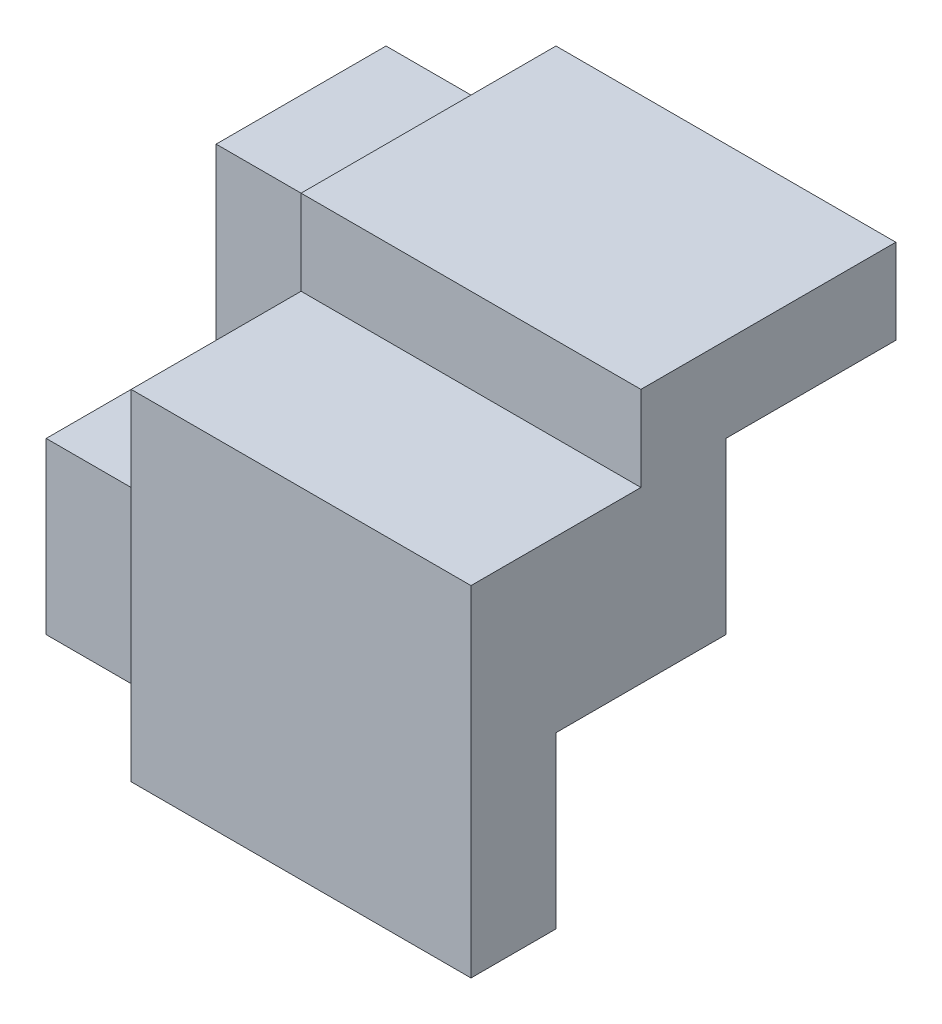
ISO-10303-21;
HEADER;
FILE_DESCRIPTION(('STEP AP214'),'2;1');
FILE_NAME('part.step','',(''),(''),'','','');
FILE_SCHEMA(('AUTOMOTIVE_DESIGN { 1 0 10303 214 1 1 1 1 }'));
ENDSEC;
DATA;
#1=APPLICATION_CONTEXT('core data for automotive mechanical design processes');
#2=APPLICATION_PROTOCOL_DEFINITION('international standard','automotive_design',2000,#1);
#3=PRODUCT_CONTEXT('',#1,'mechanical');
#4=PRODUCT('Part','Part','',(#3));
#5=PRODUCT_RELATED_PRODUCT_CATEGORY('part','',(#4));
#6=PRODUCT_DEFINITION_FORMATION('','',#4);
#7=PRODUCT_DEFINITION_CONTEXT('part definition',#1,'design');
#8=PRODUCT_DEFINITION('design','',#6,#7);
#9=PRODUCT_DEFINITION_SHAPE('','',#8);
#10=(LENGTH_UNIT() NAMED_UNIT(*) SI_UNIT(.MILLI.,.METRE.));
#11=(NAMED_UNIT(*) PLANE_ANGLE_UNIT() SI_UNIT($,.RADIAN.));
#12=(NAMED_UNIT(*) SI_UNIT($,.STERADIAN.) SOLID_ANGLE_UNIT());
#13=UNCERTAINTY_MEASURE_WITH_UNIT(LENGTH_MEASURE(1.E-05),#10,'distance_accuracy_value','');
#14=(GEOMETRIC_REPRESENTATION_CONTEXT(3) GLOBAL_UNCERTAINTY_ASSIGNED_CONTEXT((#13)) GLOBAL_UNIT_ASSIGNED_CONTEXT((#10,
#11,#12)) REPRESENTATION_CONTEXT('',''));
#15=CARTESIAN_POINT('',(0.,0.,0.));
#16=DIRECTION('',(0.,0.,1.));
#17=DIRECTION('',(1.,0.,0.));
#18=AXIS2_PLACEMENT_3D('',#15,#16,#17);
#19=CARTESIAN_POINT('',(0.,20.,0.));
#20=DIRECTION('',(0.,-1.,0.));
#21=DIRECTION('',(0.,0.,-1.));
#22=AXIS2_PLACEMENT_3D('',#19,#20,#21);
#23=PLANE('',#22);
#24=DIRECTION('',(0.,0.,-1.));
#25=VECTOR('',#24,1.);
#26=CARTESIAN_POINT('',(40.,20.,0.));
#27=LINE('',#26,#25);
#28=CARTESIAN_POINT('',(40.,20.,40.));
#29=VERTEX_POINT('',#28);
#30=CARTESIAN_POINT('',(40.,20.,20.));
#31=VERTEX_POINT('',#30);
#32=EDGE_CURVE('E181',#29,#31,#27,.T.);
#33=ORIENTED_EDGE('',*,*,#32,.T.);
#34=DIRECTION('',(-1.,0.,0.));
#35=VECTOR('',#34,1.);
#36=CARTESIAN_POINT('',(40.,20.,20.));
#37=LINE('',#36,#35);
#38=CARTESIAN_POINT('',(60.,20.,20.));
#39=VERTEX_POINT('',#38);
#40=EDGE_CURVE('E159',#39,#31,#37,.T.);
#41=ORIENTED_EDGE('',*,*,#40,.F.);
#42=DIRECTION('',(0.,0.,1.));
#43=VECTOR('',#42,1.);
#44=CARTESIAN_POINT('',(60.,20.,0.));
#45=LINE('',#44,#43);
#46=CARTESIAN_POINT('',(60.,20.,40.));
#47=VERTEX_POINT('',#46);
#48=EDGE_CURVE('E175',#39,#47,#45,.T.);
#49=ORIENTED_EDGE('',*,*,#48,.T.);
#50=DIRECTION('',(-1.,0.,0.));
#51=VECTOR('',#50,1.);
#52=CARTESIAN_POINT('',(60.,20.,40.));
#53=LINE('',#52,#51);
#54=EDGE_CURVE('E177',#47,#29,#53,.T.);
#55=ORIENTED_EDGE('',*,*,#54,.T.);
#56=EDGE_LOOP('',(#33,#41,#49,#55));
#57=FACE_BOUND('',#56,.T.);
#58=ADVANCED_FACE('F35',(#57),#23,.T.);
#59=CARTESIAN_POINT('',(0.,40.,0.));
#60=DIRECTION('',(0.,-1.,0.));
#61=DIRECTION('',(0.,0.,-1.));
#62=AXIS2_PLACEMENT_3D('',#59,#60,#61);
#63=PLANE('',#62);
#64=DIRECTION('',(1.,0.,0.));
#65=VECTOR('',#64,1.);
#66=CARTESIAN_POINT('',(60.,40.,30.));
#67=LINE('',#66,#65);
#68=CARTESIAN_POINT('',(20.,40.,30.));
#69=VERTEX_POINT('',#68);
#70=CARTESIAN_POINT('',(60.,40.,30.));
#71=VERTEX_POINT('',#70);
#72=EDGE_CURVE('E58',#69,#71,#67,.T.);
#73=ORIENTED_EDGE('',*,*,#72,.F.);
#74=DIRECTION('',(0.,0.,-1.));
#75=VECTOR('',#74,1.);
#76=CARTESIAN_POINT('',(20.,40.,0.));
#77=LINE('',#76,#75);
#78=CARTESIAN_POINT('',(20.,40.,50.));
#79=VERTEX_POINT('',#78);
#80=EDGE_CURVE('E11',#79,#69,#77,.T.);
#81=ORIENTED_EDGE('',*,*,#80,.F.);
#82=DIRECTION('',(1.,0.,0.));
#83=VECTOR('',#82,1.);
#84=CARTESIAN_POINT('',(60.,40.,50.));
#85=LINE('',#84,#83);
#86=CARTESIAN_POINT('',(60.,40.,50.));
#87=VERTEX_POINT('',#86);
#88=EDGE_CURVE('E224',#79,#87,#85,.T.);
#89=ORIENTED_EDGE('',*,*,#88,.T.);
#90=DIRECTION('',(0.,0.,1.));
#91=VECTOR('',#90,1.);
#92=CARTESIAN_POINT('',(60.,40.,20.));
#93=LINE('',#92,#91);
#94=EDGE_CURVE('E227',#71,#87,#93,.T.);
#95=ORIENTED_EDGE('',*,*,#94,.F.);
#96=EDGE_LOOP('',(#73,#81,#89,#95));
#97=FACE_BOUND('',#96,.T.);
#98=ADVANCED_FACE('F325',(#97),#63,.F.);
#99=CARTESIAN_POINT('',(0.,0.,50.));
#100=DIRECTION('',(1.,0.,0.));
#101=DIRECTION('',(0.,0.,-1.));
#102=AXIS2_PLACEMENT_3D('',#99,#100,#101);
#103=PLANE('',#102);
#104=DIRECTION('',(0.,-1.,0.));
#105=VECTOR('',#104,1.);
#106=CARTESIAN_POINT('',(0.,20.,40.));
#107=LINE('',#106,#105);
#108=CARTESIAN_POINT('',(0.,20.,40.));
#109=VERTEX_POINT('',#108);
#110=CARTESIAN_POINT('',(0.,0.,40.));
#111=VERTEX_POINT('',#110);
#112=EDGE_CURVE('E201',#109,#111,#107,.T.);
#113=ORIENTED_EDGE('',*,*,#112,.F.);
#114=DIRECTION('',(0.,0.,1.));
#115=VECTOR('',#114,1.);
#116=CARTESIAN_POINT('',(0.,20.,30.));
#117=LINE('',#116,#115);
#118=CARTESIAN_POINT('',(0.,20.,20.));
#119=VERTEX_POINT('',#118);
#120=EDGE_CURVE('E229',#119,#109,#117,.T.);
#121=ORIENTED_EDGE('',*,*,#120,.F.);
#122=DIRECTION('',(0.,-1.,0.));
#123=VECTOR('',#122,1.);
#124=CARTESIAN_POINT('',(0.,20.,20.));
#125=LINE('',#124,#123);
#126=CARTESIAN_POINT('',(0.,40.,20.));
#127=VERTEX_POINT('',#126);
#128=EDGE_CURVE('E218',#127,#119,#125,.T.);
#129=ORIENTED_EDGE('',*,*,#128,.F.);
#130=DIRECTION('',(0.,0.,1.));
#131=VECTOR('',#130,1.);
#132=CARTESIAN_POINT('',(0.,40.,0.));
#133=LINE('',#132,#131);
#134=CARTESIAN_POINT('',(0.,40.,0.));
#135=VERTEX_POINT('',#134);
#136=EDGE_CURVE('E242',#135,#127,#133,.T.);
#137=ORIENTED_EDGE('',*,*,#136,.F.);
#138=DIRECTION('',(0.,-1.,0.));
#139=VECTOR('',#138,1.);
#140=CARTESIAN_POINT('',(0.,0.,0.));
#141=LINE('',#140,#139);
#142=CARTESIAN_POINT('',(0.,0.,0.));
#143=VERTEX_POINT('',#142);
#144=EDGE_CURVE('E247',#135,#143,#141,.T.);
#145=ORIENTED_EDGE('',*,*,#144,.T.);
#146=DIRECTION('',(0.,0.,-1.));
#147=VECTOR('',#146,1.);
#148=CARTESIAN_POINT('',(0.,0.,50.));
#149=LINE('',#148,#147);
#150=EDGE_CURVE('E43',#111,#143,#149,.T.);
#151=ORIENTED_EDGE('',*,*,#150,.F.);
#152=EDGE_LOOP('',(#113,#121,#129,#137,#145,#151));
#153=FACE_BOUND('',#152,.T.);
#154=ADVANCED_FACE('F37',(#153),#103,.F.);
#155=CARTESIAN_POINT('',(0.,20.,30.));
#156=DIRECTION('',(0.,-1.,0.));
#157=DIRECTION('',(0.,0.,-1.));
#158=AXIS2_PLACEMENT_3D('',#155,#156,#157);
#159=PLANE('',#158);
#160=DIRECTION('',(-1.,0.,0.));
#161=VECTOR('',#160,1.);
#162=CARTESIAN_POINT('',(0.,20.,40.));
#163=LINE('',#162,#161);
#164=CARTESIAN_POINT('',(20.,20.,40.));
#165=VERTEX_POINT('',#164);
#166=EDGE_CURVE('E208',#165,#109,#163,.T.);
#167=ORIENTED_EDGE('',*,*,#166,.F.);
#168=DIRECTION('',(0.,0.,1.));
#169=VECTOR('',#168,1.);
#170=CARTESIAN_POINT('',(20.,20.,30.));
#171=LINE('',#170,#169);
#172=CARTESIAN_POINT('',(20.,20.,20.));
#173=VERTEX_POINT('',#172);
#174=EDGE_CURVE('E230',#173,#165,#171,.T.);
#175=ORIENTED_EDGE('',*,*,#174,.F.);
#176=DIRECTION('',(1.,0.,0.));
#177=VECTOR('',#176,1.);
#178=CARTESIAN_POINT('',(20.,20.,20.));
#179=LINE('',#178,#177);
#180=EDGE_CURVE('E221',#119,#173,#179,.T.);
#181=ORIENTED_EDGE('',*,*,#180,.F.);
#182=ORIENTED_EDGE('',*,*,#120,.T.);
#183=EDGE_LOOP('',(#167,#175,#181,#182));
#184=FACE_BOUND('',#183,.T.);
#185=ADVANCED_FACE('F312',(#184),#159,.F.);
#186=DIRECTION('',(-1.,0.,0.));
#187=VECTOR('',#186,1.);
#188=CARTESIAN_POINT('',(20.,40.,20.));
#189=LINE('',#188,#187);
#190=CARTESIAN_POINT('',(20.,40.,20.));
#191=VERTEX_POINT('',#190);
#192=EDGE_CURVE('E216',#191,#127,#189,.T.);
#193=ORIENTED_EDGE('',*,*,#192,.F.);
#194=DIRECTION('',(0.,0.,1.));
#195=VECTOR('',#194,1.);
#196=CARTESIAN_POINT('',(20.,40.,0.));
#197=LINE('',#196,#195);
#198=CARTESIAN_POINT('',(20.,40.,0.));
#199=VERTEX_POINT('',#198);
#200=EDGE_CURVE('E248',#199,#191,#197,.T.);
#201=ORIENTED_EDGE('',*,*,#200,.F.);
#202=DIRECTION('',(1.,0.,0.));
#203=VECTOR('',#202,1.);
#204=CARTESIAN_POINT('',(0.,40.,0.));
#205=LINE('',#204,#203);
#206=EDGE_CURVE('E236',#135,#199,#205,.T.);
#207=ORIENTED_EDGE('',*,*,#206,.F.);
#208=ORIENTED_EDGE('',*,*,#136,.T.);
#209=EDGE_LOOP('',(#193,#201,#207,#208));
#210=FACE_BOUND('',#209,.T.);
#211=ADVANCED_FACE('F317',(#210),#63,.F.);
#212=CARTESIAN_POINT('',(0.,0.,50.));
#213=DIRECTION('',(0.,1.,0.));
#214=DIRECTION('',(0.,0.,1.));
#215=AXIS2_PLACEMENT_3D('',#212,#213,#214);
#216=PLANE('',#215);
#217=DIRECTION('',(1.,0.,0.));
#218=VECTOR('',#217,1.);
#219=CARTESIAN_POINT('',(0.,0.,0.));
#220=LINE('',#219,#218);
#221=CARTESIAN_POINT('',(40.,0.,0.));
#222=VERTEX_POINT('',#221);
#223=EDGE_CURVE('E261',#143,#222,#220,.T.);
#224=ORIENTED_EDGE('',*,*,#223,.T.);
#225=DIRECTION('',(0.,0.,-1.));
#226=VECTOR('',#225,1.);
#227=CARTESIAN_POINT('',(40.,0.,0.));
#228=LINE('',#227,#226);
#229=CARTESIAN_POINT('',(40.,0.,40.));
#230=VERTEX_POINT('',#229);
#231=EDGE_CURVE('E178',#230,#222,#228,.T.);
#232=ORIENTED_EDGE('',*,*,#231,.F.);
#233=DIRECTION('',(-1.,0.,0.));
#234=VECTOR('',#233,1.);
#235=CARTESIAN_POINT('',(60.,0.,40.));
#236=LINE('',#235,#234);
#237=CARTESIAN_POINT('',(60.,0.,40.));
#238=VERTEX_POINT('',#237);
#239=EDGE_CURVE('E173',#238,#230,#236,.T.);
#240=ORIENTED_EDGE('',*,*,#239,.F.);
#241=DIRECTION('',(0.,0.,-1.));
#242=VECTOR('',#241,1.);
#243=CARTESIAN_POINT('',(60.,0.,50.));
#244=LINE('',#243,#242);
#245=CARTESIAN_POINT('',(60.,0.,50.));
#246=VERTEX_POINT('',#245);
#247=EDGE_CURVE('E270',#246,#238,#244,.T.);
#248=ORIENTED_EDGE('',*,*,#247,.F.);
#249=DIRECTION('',(1.,0.,0.));
#250=VECTOR('',#249,1.);
#251=CARTESIAN_POINT('',(0.,0.,50.));
#252=LINE('',#251,#250);
#253=CARTESIAN_POINT('',(20.,0.,50.));
#254=VERTEX_POINT('',#253);
#255=EDGE_CURVE('E252',#254,#246,#252,.T.);
#256=ORIENTED_EDGE('',*,*,#255,.F.);
#257=DIRECTION('',(0.,0.,1.));
#258=VECTOR('',#257,1.);
#259=CARTESIAN_POINT('',(20.,0.,40.));
#260=LINE('',#259,#258);
#261=CARTESIAN_POINT('',(20.,0.,40.));
#262=VERTEX_POINT('',#261);
#263=EDGE_CURVE('E210',#262,#254,#260,.T.);
#264=ORIENTED_EDGE('',*,*,#263,.F.);
#265=DIRECTION('',(1.,0.,0.));
#266=VECTOR('',#265,1.);
#267=CARTESIAN_POINT('',(0.,0.,40.));
#268=LINE('',#267,#266);
#269=EDGE_CURVE('E203',#111,#262,#268,.T.);
#270=ORIENTED_EDGE('',*,*,#269,.F.);
#271=ORIENTED_EDGE('',*,*,#150,.T.);
#272=EDGE_LOOP('',(#224,#232,#240,#248,#256,#264,#270,#271));
#273=FACE_BOUND('',#272,.T.);
#274=ADVANCED_FACE('F275',(#273),#216,.F.);
#275=CARTESIAN_POINT('',(60.,0.,50.));
#276=DIRECTION('',(-1.,0.,0.));
#277=DIRECTION('',(0.,0.,1.));
#278=AXIS2_PLACEMENT_3D('',#275,#276,#277);
#279=PLANE('',#278);
#280=DIRECTION('',(0.,-1.,0.));
#281=VECTOR('',#280,1.);
#282=CARTESIAN_POINT('',(60.,20.,20.));
#283=LINE('',#282,#281);
#284=CARTESIAN_POINT('',(60.,40.,20.));
#285=VERTEX_POINT('',#284);
#286=EDGE_CURVE('E50',#285,#39,#283,.T.);
#287=ORIENTED_EDGE('',*,*,#286,.F.);
#288=DIRECTION('',(0.,0.,-1.));
#289=VECTOR('',#288,1.);
#290=CARTESIAN_POINT('',(60.,40.,20.));
#291=LINE('',#290,#289);
#292=CARTESIAN_POINT('',(60.,40.,0.));
#293=VERTEX_POINT('',#292);
#294=EDGE_CURVE('E158',#285,#293,#291,.T.);
#295=ORIENTED_EDGE('',*,*,#294,.T.);
#296=DIRECTION('',(0.,1.,0.));
#297=VECTOR('',#296,1.);
#298=CARTESIAN_POINT('',(60.,0.,0.));
#299=LINE('',#298,#297);
#300=CARTESIAN_POINT('',(60.,50.,0.));
#301=VERTEX_POINT('',#300);
#302=EDGE_CURVE('E264',#293,#301,#299,.T.);
#303=ORIENTED_EDGE('',*,*,#302,.T.);
#304=DIRECTION('',(0.,0.,-1.));
#305=VECTOR('',#304,1.);
#306=CARTESIAN_POINT('',(60.,50.,50.));
#307=LINE('',#306,#305);
#308=CARTESIAN_POINT('',(60.,50.,30.));
#309=VERTEX_POINT('',#308);
#310=EDGE_CURVE('E258',#309,#301,#307,.T.);
#311=ORIENTED_EDGE('',*,*,#310,.F.);
#312=DIRECTION('',(0.,1.,0.));
#313=VECTOR('',#312,1.);
#314=CARTESIAN_POINT('',(60.,50.,30.));
#315=LINE('',#314,#313);
#316=EDGE_CURVE('E188',#71,#309,#315,.T.);
#317=ORIENTED_EDGE('',*,*,#316,.F.);
#318=ORIENTED_EDGE('',*,*,#94,.T.);
#319=DIRECTION('',(0.,1.,0.));
#320=VECTOR('',#319,1.);
#321=CARTESIAN_POINT('',(60.,0.,50.));
#322=LINE('',#321,#320);
#323=EDGE_CURVE('E254',#246,#87,#322,.T.);
#324=ORIENTED_EDGE('',*,*,#323,.F.);
#325=ORIENTED_EDGE('',*,*,#247,.T.);
#326=DIRECTION('',(0.,-1.,0.));
#327=VECTOR('',#326,1.);
#328=CARTESIAN_POINT('',(60.,20.,40.));
#329=LINE('',#328,#327);
#330=EDGE_CURVE('E183',#47,#238,#329,.T.);
#331=ORIENTED_EDGE('',*,*,#330,.F.);
#332=ORIENTED_EDGE('',*,*,#48,.F.);
#333=EDGE_LOOP('',(#287,#295,#303,#311,#317,#318,#324,#325,#331,#332));
#334=FACE_BOUND('',#333,.T.);
#335=ADVANCED_FACE('F289',(#334),#279,.F.);
#336=CARTESIAN_POINT('',(0.,50.,50.));
#337=DIRECTION('',(0.,-1.,0.));
#338=DIRECTION('',(0.,0.,-1.));
#339=AXIS2_PLACEMENT_3D('',#336,#337,#338);
#340=PLANE('',#339);
#341=DIRECTION('',(0.,0.,1.));
#342=VECTOR('',#341,1.);
#343=CARTESIAN_POINT('',(20.,50.,0.));
#344=LINE('',#343,#342);
#345=CARTESIAN_POINT('',(20.,50.,0.));
#346=VERTEX_POINT('',#345);
#347=CARTESIAN_POINT('',(20.,50.,30.));
#348=VERTEX_POINT('',#347);
#349=EDGE_CURVE('E245',#346,#348,#344,.T.);
#350=ORIENTED_EDGE('',*,*,#349,.T.);
#351=DIRECTION('',(-1.,0.,0.));
#352=VECTOR('',#351,1.);
#353=CARTESIAN_POINT('',(60.,50.,30.));
#354=LINE('',#353,#352);
#355=EDGE_CURVE('E194',#309,#348,#354,.T.);
#356=ORIENTED_EDGE('',*,*,#355,.F.);
#357=ORIENTED_EDGE('',*,*,#310,.T.);
#358=DIRECTION('',(-1.,0.,0.));
#359=VECTOR('',#358,1.);
#360=CARTESIAN_POINT('',(0.,50.,0.));
#361=LINE('',#360,#359);
#362=EDGE_CURVE('E255',#301,#346,#361,.T.);
#363=ORIENTED_EDGE('',*,*,#362,.T.);
#364=EDGE_LOOP('',(#350,#356,#357,#363));
#365=FACE_BOUND('',#364,.T.);
#366=ADVANCED_FACE('F320',(#365),#340,.F.);
#367=CARTESIAN_POINT('',(0.,0.,50.));
#368=DIRECTION('',(0.,0.,-1.));
#369=DIRECTION('',(-1.,0.,0.));
#370=AXIS2_PLACEMENT_3D('',#367,#368,#369);
#371=PLANE('',#370);
#372=DIRECTION('',(0.,1.,0.));
#373=VECTOR('',#372,1.);
#374=CARTESIAN_POINT('',(20.,50.,50.));
#375=LINE('',#374,#373);
#376=EDGE_CURVE('E233',#254,#79,#375,.T.);
#377=ORIENTED_EDGE('',*,*,#376,.F.);
#378=ORIENTED_EDGE('',*,*,#255,.T.);
#379=ORIENTED_EDGE('',*,*,#323,.T.);
#380=ORIENTED_EDGE('',*,*,#88,.F.);
#381=EDGE_LOOP('',(#377,#378,#379,#380));
#382=FACE_BOUND('',#381,.T.);
#383=ADVANCED_FACE('F303',(#382),#371,.F.);
#384=CARTESIAN_POINT('',(0.,0.,0.));
#385=DIRECTION('',(0.,0.,-1.));
#386=DIRECTION('',(-1.,0.,0.));
#387=AXIS2_PLACEMENT_3D('',#384,#385,#386);
#388=PLANE('',#387);
#389=DIRECTION('',(1.,0.,0.));
#390=VECTOR('',#389,1.);
#391=CARTESIAN_POINT('',(40.,40.,0.));
#392=LINE('',#391,#390);
#393=CARTESIAN_POINT('',(40.,40.,0.));
#394=VERTEX_POINT('',#393);
#395=EDGE_CURVE('E167',#394,#293,#392,.T.);
#396=ORIENTED_EDGE('',*,*,#395,.F.);
#397=DIRECTION('',(0.,-1.,0.));
#398=VECTOR('',#397,1.);
#399=CARTESIAN_POINT('',(40.,20.,0.));
#400=LINE('',#399,#398);
#401=EDGE_CURVE('E155',#394,#222,#400,.T.);
#402=ORIENTED_EDGE('',*,*,#401,.T.);
#403=ORIENTED_EDGE('',*,*,#223,.F.);
#404=ORIENTED_EDGE('',*,*,#144,.F.);
#405=ORIENTED_EDGE('',*,*,#206,.T.);
#406=DIRECTION('',(0.,1.,0.));
#407=VECTOR('',#406,1.);
#408=CARTESIAN_POINT('',(20.,50.,0.));
#409=LINE('',#408,#407);
#410=EDGE_CURVE('E239',#199,#346,#409,.T.);
#411=ORIENTED_EDGE('',*,*,#410,.T.);
#412=ORIENTED_EDGE('',*,*,#362,.F.);
#413=ORIENTED_EDGE('',*,*,#302,.F.);
#414=EDGE_LOOP('',(#396,#402,#403,#404,#405,#411,#412,#413));
#415=FACE_BOUND('',#414,.T.);
#416=ADVANCED_FACE('F285',(#415),#388,.T.);
#417=CARTESIAN_POINT('',(20.,50.,0.));
#418=DIRECTION('',(1.,0.,0.));
#419=DIRECTION('',(0.,0.,-1.));
#420=AXIS2_PLACEMENT_3D('',#417,#418,#419);
#421=PLANE('',#420);
#422=ORIENTED_EDGE('',*,*,#200,.T.);
#423=DIRECTION('',(0.,1.,0.));
#424=VECTOR('',#423,1.);
#425=CARTESIAN_POINT('',(20.,20.,20.));
#426=LINE('',#425,#424);
#427=EDGE_CURVE('E213',#173,#191,#426,.T.);
#428=ORIENTED_EDGE('',*,*,#427,.F.);
#429=ORIENTED_EDGE('',*,*,#174,.T.);
#430=DIRECTION('',(0.,1.,0.));
#431=VECTOR('',#430,1.);
#432=CARTESIAN_POINT('',(20.,20.,40.));
#433=LINE('',#432,#431);
#434=EDGE_CURVE('E206',#262,#165,#433,.T.);
#435=ORIENTED_EDGE('',*,*,#434,.F.);
#436=ORIENTED_EDGE('',*,*,#263,.T.);
#437=ORIENTED_EDGE('',*,*,#376,.T.);
#438=ORIENTED_EDGE('',*,*,#80,.T.);
#439=DIRECTION('',(0.,-1.,0.));
#440=VECTOR('',#439,1.);
#441=CARTESIAN_POINT('',(20.,50.,30.));
#442=LINE('',#441,#440);
#443=EDGE_CURVE('E197',#348,#69,#442,.T.);
#444=ORIENTED_EDGE('',*,*,#443,.F.);
#445=ORIENTED_EDGE('',*,*,#349,.F.);
#446=ORIENTED_EDGE('',*,*,#410,.F.);
#447=EDGE_LOOP('',(#422,#428,#429,#435,#436,#437,#438,#444,#445,#446));
#448=FACE_BOUND('',#447,.T.);
#449=ADVANCED_FACE('F305',(#448),#421,.F.);
#450=CARTESIAN_POINT('',(0.,0.,20.));
#451=DIRECTION('',(0.,0.,1.));
#452=DIRECTION('',(1.,0.,0.));
#453=AXIS2_PLACEMENT_3D('',#450,#451,#452);
#454=PLANE('',#453);
#455=ORIENTED_EDGE('',*,*,#427,.T.);
#456=ORIENTED_EDGE('',*,*,#192,.T.);
#457=ORIENTED_EDGE('',*,*,#128,.T.);
#458=ORIENTED_EDGE('',*,*,#180,.T.);
#459=EDGE_LOOP('',(#455,#456,#457,#458));
#460=FACE_BOUND('',#459,.T.);
#461=ADVANCED_FACE('F314',(#460),#454,.T.);
#462=CARTESIAN_POINT('',(0.,0.,40.));
#463=DIRECTION('',(0.,0.,1.));
#464=DIRECTION('',(1.,0.,0.));
#465=AXIS2_PLACEMENT_3D('',#462,#463,#464);
#466=PLANE('',#465);
#467=ORIENTED_EDGE('',*,*,#112,.T.);
#468=ORIENTED_EDGE('',*,*,#269,.T.);
#469=ORIENTED_EDGE('',*,*,#434,.T.);
#470=ORIENTED_EDGE('',*,*,#166,.T.);
#471=EDGE_LOOP('',(#467,#468,#469,#470));
#472=FACE_BOUND('',#471,.T.);
#473=ADVANCED_FACE('F309',(#472),#466,.T.);
#474=CARTESIAN_POINT('',(0.,0.,30.));
#475=DIRECTION('',(0.,0.,-1.));
#476=DIRECTION('',(-1.,0.,0.));
#477=AXIS2_PLACEMENT_3D('',#474,#475,#476);
#478=PLANE('',#477);
#479=ORIENTED_EDGE('',*,*,#316,.T.);
#480=ORIENTED_EDGE('',*,*,#355,.T.);
#481=ORIENTED_EDGE('',*,*,#443,.T.);
#482=ORIENTED_EDGE('',*,*,#72,.T.);
#483=EDGE_LOOP('',(#479,#480,#481,#482));
#484=FACE_BOUND('',#483,.T.);
#485=ADVANCED_FACE('F323',(#484),#478,.F.);
#486=CARTESIAN_POINT('',(40.,20.,0.));
#487=DIRECTION('',(-1.,0.,0.));
#488=DIRECTION('',(0.,0.,1.));
#489=AXIS2_PLACEMENT_3D('',#486,#487,#488);
#490=PLANE('',#489);
#491=ORIENTED_EDGE('',*,*,#231,.T.);
#492=ORIENTED_EDGE('',*,*,#401,.F.);
#493=DIRECTION('',(0.,0.,-1.));
#494=VECTOR('',#493,1.);
#495=CARTESIAN_POINT('',(40.,40.,20.));
#496=LINE('',#495,#494);
#497=CARTESIAN_POINT('',(40.,40.,20.));
#498=VERTEX_POINT('',#497);
#499=EDGE_CURVE('E148',#498,#394,#496,.T.);
#500=ORIENTED_EDGE('',*,*,#499,.F.);
#501=DIRECTION('',(0.,1.,0.));
#502=VECTOR('',#501,1.);
#503=CARTESIAN_POINT('',(40.,20.,20.));
#504=LINE('',#503,#502);
#505=EDGE_CURVE('E153',#31,#498,#504,.T.);
#506=ORIENTED_EDGE('',*,*,#505,.F.);
#507=ORIENTED_EDGE('',*,*,#32,.F.);
#508=DIRECTION('',(0.,-1.,0.));
#509=VECTOR('',#508,1.);
#510=CARTESIAN_POINT('',(40.,20.,40.));
#511=LINE('',#510,#509);
#512=EDGE_CURVE('E189',#29,#230,#511,.T.);
#513=ORIENTED_EDGE('',*,*,#512,.T.);
#514=EDGE_LOOP('',(#491,#492,#500,#506,#507,#513));
#515=FACE_BOUND('',#514,.T.);
#516=ADVANCED_FACE('F150',(#515),#490,.F.);
#517=CARTESIAN_POINT('',(60.,20.,40.));
#518=DIRECTION('',(0.,0.,1.));
#519=DIRECTION('',(1.,0.,0.));
#520=AXIS2_PLACEMENT_3D('',#517,#518,#519);
#521=PLANE('',#520);
#522=ORIENTED_EDGE('',*,*,#239,.T.);
#523=ORIENTED_EDGE('',*,*,#512,.F.);
#524=ORIENTED_EDGE('',*,*,#54,.F.);
#525=ORIENTED_EDGE('',*,*,#330,.T.);
#526=EDGE_LOOP('',(#522,#523,#524,#525));
#527=FACE_BOUND('',#526,.T.);
#528=ADVANCED_FACE('F295',(#527),#521,.F.);
#529=CARTESIAN_POINT('',(40.,40.,20.));
#530=DIRECTION('',(0.,1.,0.));
#531=DIRECTION('',(0.,0.,1.));
#532=AXIS2_PLACEMENT_3D('',#529,#530,#531);
#533=PLANE('',#532);
#534=ORIENTED_EDGE('',*,*,#395,.T.);
#535=ORIENTED_EDGE('',*,*,#294,.F.);
#536=DIRECTION('',(1.,0.,0.));
#537=VECTOR('',#536,1.);
#538=CARTESIAN_POINT('',(40.,40.,20.));
#539=LINE('',#538,#537);
#540=EDGE_CURVE('E161',#498,#285,#539,.T.);
#541=ORIENTED_EDGE('',*,*,#540,.F.);
#542=ORIENTED_EDGE('',*,*,#499,.T.);
#543=EDGE_LOOP('',(#534,#535,#541,#542));
#544=FACE_BOUND('',#543,.T.);
#545=ADVANCED_FACE('F162',(#544),#533,.F.);
#546=CARTESIAN_POINT('',(0.,0.,20.));
#547=DIRECTION('',(0.,0.,-1.));
#548=DIRECTION('',(-1.,0.,0.));
#549=AXIS2_PLACEMENT_3D('',#546,#547,#548);
#550=PLANE('',#549);
#551=ORIENTED_EDGE('',*,*,#505,.T.);
#552=ORIENTED_EDGE('',*,*,#540,.T.);
#553=ORIENTED_EDGE('',*,*,#286,.T.);
#554=ORIENTED_EDGE('',*,*,#40,.T.);
#555=EDGE_LOOP('',(#551,#552,#553,#554));
#556=FACE_BOUND('',#555,.T.);
#557=ADVANCED_FACE('F165',(#556),#550,.T.);
#558=CLOSED_SHELL('',(#58,#98,#154,#185,#211,#274,#335,#366,#383,#416,#449,#461,#473,#485,#516,
#528,#545,#557));
#559=MANIFOLD_SOLID_BREP('B2',#558);
#560=ADVANCED_BREP_SHAPE_REPRESENTATION('',(#18,#559),#14);
#561=SHAPE_DEFINITION_REPRESENTATION(#9,#560);
ENDSEC;
END-ISO-10303-21;
